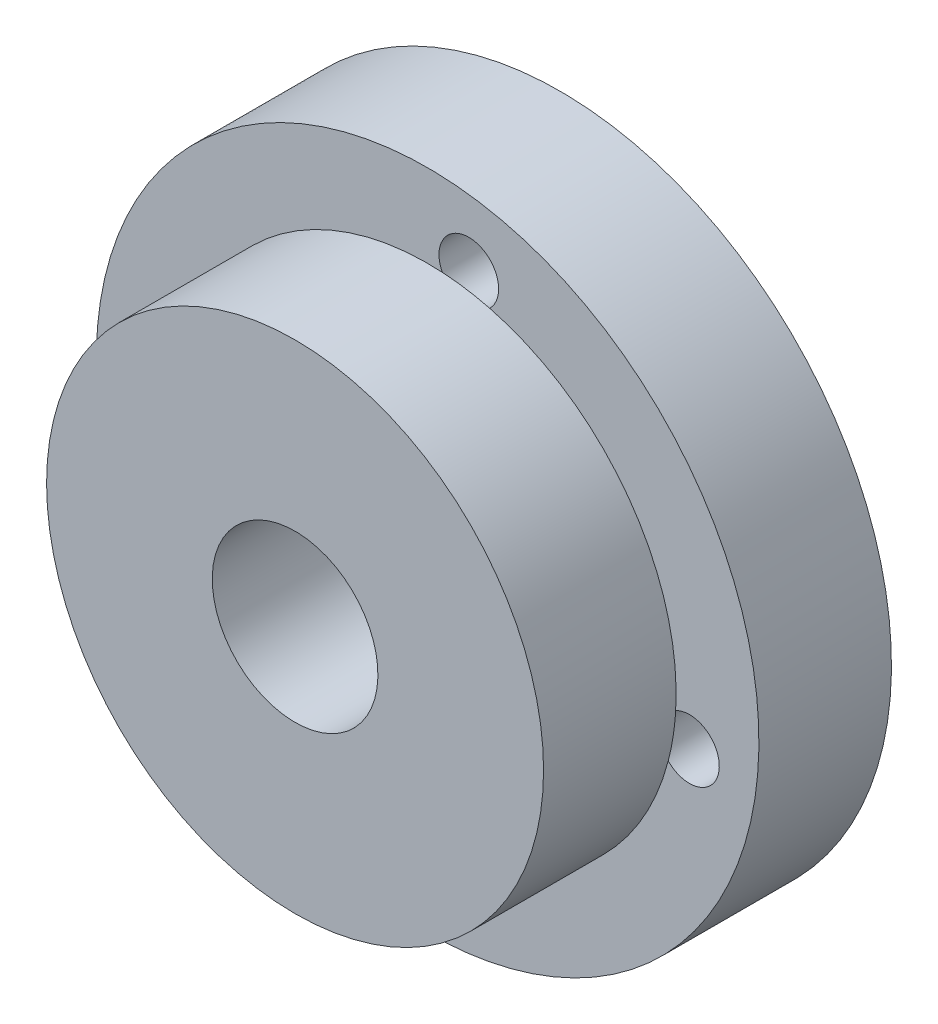
ISO-10303-21;
HEADER;
FILE_DESCRIPTION(('STEP AP214'),'2;1');
FILE_NAME('part.step','',(''),(''),'','','');
FILE_SCHEMA(('AUTOMOTIVE_DESIGN { 1 0 10303 214 1 1 1 1 }'));
ENDSEC;
DATA;
#1=APPLICATION_CONTEXT('core data for automotive mechanical design processes');
#2=APPLICATION_PROTOCOL_DEFINITION('international standard','automotive_design',2000,#1);
#3=PRODUCT_CONTEXT('',#1,'mechanical');
#4=PRODUCT('Part','Part','',(#3));
#5=PRODUCT_RELATED_PRODUCT_CATEGORY('part','',(#4));
#6=PRODUCT_DEFINITION_FORMATION('','',#4);
#7=PRODUCT_DEFINITION_CONTEXT('part definition',#1,'design');
#8=PRODUCT_DEFINITION('design','',#6,#7);
#9=PRODUCT_DEFINITION_SHAPE('','',#8);
#10=(LENGTH_UNIT() NAMED_UNIT(*) SI_UNIT(.MILLI.,.METRE.));
#11=(NAMED_UNIT(*) PLANE_ANGLE_UNIT() SI_UNIT($,.RADIAN.));
#12=(NAMED_UNIT(*) SI_UNIT($,.STERADIAN.) SOLID_ANGLE_UNIT());
#13=UNCERTAINTY_MEASURE_WITH_UNIT(LENGTH_MEASURE(1.E-05),#10,'distance_accuracy_value','');
#14=(GEOMETRIC_REPRESENTATION_CONTEXT(3) GLOBAL_UNCERTAINTY_ASSIGNED_CONTEXT((#13)) GLOBAL_UNIT_ASSIGNED_CONTEXT((#10,
#11,#12)) REPRESENTATION_CONTEXT('',''));
#15=CARTESIAN_POINT('',(0.,0.,0.));
#16=DIRECTION('',(0.,0.,1.));
#17=DIRECTION('',(1.,0.,0.));
#18=AXIS2_PLACEMENT_3D('',#15,#16,#17);
#19=CARTESIAN_POINT('',(172.540515397,-49.500004703,194.848278345));
#20=DIRECTION('',(0.,0.,1.));
#21=DIRECTION('',(1.,0.,0.));
#22=AXIS2_PLACEMENT_3D('',#19,#20,#21);
#23=PLANE('',#22);
#24=CARTESIAN_POINT('',(172.540515397,-49.500004703,194.848278345));
#25=DIRECTION('',(0.,0.,1.));
#26=DIRECTION('',(-0.987847219012841,0.15542802800202,0.));
#27=AXIS2_PLACEMENT_3D('',#24,#25,#26);
#28=CIRCLE('',#27,2.5);
#29=CARTESIAN_POINT('',(170.07089735,-49.111434632,194.848278345));
#30=VERTEX_POINT('',#29);
#31=CARTESIAN_POINT('',(175.010133445,-49.888574774,194.848278345));
#32=VERTEX_POINT('',#31);
#33=EDGE_CURVE('E207',#30,#32,#28,.T.);
#34=ORIENTED_EDGE('',*,*,#33,.T.);
#35=CARTESIAN_POINT('',(172.540515397,-49.500004703,194.848278345));
#36=DIRECTION('',(0.,0.,1.));
#37=DIRECTION('',(-0.987847219012841,0.15542802800202,0.));
#38=AXIS2_PLACEMENT_3D('',#35,#36,#37);
#39=CIRCLE('',#38,2.5);
#40=EDGE_CURVE('E165',#32,#30,#39,.T.);
#41=ORIENTED_EDGE('',*,*,#40,.T.);
#42=EDGE_LOOP('',(#34,#41));
#43=FACE_BOUND('',#42,.T.);
#44=CARTESIAN_POINT('',(180.443293149,-50.74342893,194.848278345));
#45=DIRECTION('',(0.,0.,1.));
#46=DIRECTION('',(0.987847219012841,-0.15542802800202,0.));
#47=AXIS2_PLACEMENT_3D('',#44,#45,#46);
#48=CIRCLE('',#47,0.9);
#49=CARTESIAN_POINT('',(181.332355646,-50.883314155,194.848278345));
#50=VERTEX_POINT('',#49);
#51=EDGE_CURVE('E258',#50,#50,#48,.T.);
#52=ORIENTED_EDGE('',*,*,#51,.T.);
#53=EDGE_LOOP('',(#52));
#54=FACE_BOUND('',#53,.T.);
#55=CARTESIAN_POINT('',(173.783939624,-41.597226951,194.848278345));
#56=DIRECTION('',(0.,0.,1.));
#57=DIRECTION('',(0.987847219012841,-0.15542802800202,0.));
#58=AXIS2_PLACEMENT_3D('',#55,#56,#57);
#59=CIRCLE('',#58,0.9);
#60=CARTESIAN_POINT('',(174.673002121,-41.737112177,194.848278345));
#61=VERTEX_POINT('',#60);
#62=CARTESIAN_POINT('',(173.923824849,-40.708164454,194.848278345));
#63=VERTEX_POINT('',#62);
#64=EDGE_CURVE('E225',#61,#63,#59,.T.);
#65=ORIENTED_EDGE('',*,*,#64,.T.);
#66=CARTESIAN_POINT('',(173.783939624,-41.597226951,194.848278345));
#67=DIRECTION('',(0.,0.,1.));
#68=DIRECTION('',(0.987847219012841,-0.15542802800202,0.));
#69=AXIS2_PLACEMENT_3D('',#66,#67,#68);
#70=CIRCLE('',#69,0.9);
#71=EDGE_CURVE('E229',#63,#61,#70,.T.);
#72=ORIENTED_EDGE('',*,*,#71,.T.);
#73=EDGE_LOOP('',(#65,#72));
#74=FACE_BOUND('',#73,.T.);
#75=CARTESIAN_POINT('',(164.637737646,-48.256580477,194.848278346));
#76=DIRECTION('',(0.,0.,1.));
#77=DIRECTION('',(0.987847219012841,-0.15542802800202,0.));
#78=AXIS2_PLACEMENT_3D('',#75,#76,#77);
#79=CIRCLE('',#78,0.9);
#80=CARTESIAN_POINT('',(165.526800143,-48.396465702,194.848278345));
#81=VERTEX_POINT('',#80);
#82=CARTESIAN_POINT('',(163.748675149,-48.116695251,194.848278346));
#83=VERTEX_POINT('',#82);
#84=EDGE_CURVE('E238',#81,#83,#79,.T.);
#85=ORIENTED_EDGE('',*,*,#84,.T.);
#86=CARTESIAN_POINT('',(164.637737646,-48.256580477,194.848278346));
#87=DIRECTION('',(0.,0.,1.));
#88=DIRECTION('',(0.987847219012841,-0.15542802800202,0.));
#89=AXIS2_PLACEMENT_3D('',#86,#87,#88);
#90=CIRCLE('',#89,0.9);
#91=EDGE_CURVE('E235',#83,#81,#90,.T.);
#92=ORIENTED_EDGE('',*,*,#91,.T.);
#93=EDGE_LOOP('',(#85,#92));
#94=FACE_BOUND('',#93,.T.);
#95=CARTESIAN_POINT('',(171.297091171,-57.402782455,194.848278345));
#96=DIRECTION('',(0.,0.,1.));
#97=DIRECTION('',(0.987847219012841,-0.15542802800202,0.));
#98=AXIS2_PLACEMENT_3D('',#95,#96,#97);
#99=CIRCLE('',#98,0.9);
#100=CARTESIAN_POINT('',(172.186153668,-57.54266768,194.848278345));
#101=VERTEX_POINT('',#100);
#102=CARTESIAN_POINT('',(171.157205945,-58.291844952,194.848278345));
#103=VERTEX_POINT('',#102);
#104=EDGE_CURVE('E19',#101,#103,#99,.T.);
#105=ORIENTED_EDGE('',*,*,#104,.T.);
#106=CARTESIAN_POINT('',(171.297091171,-57.402782455,194.848278345));
#107=DIRECTION('',(0.,0.,1.));
#108=DIRECTION('',(0.987847219012841,-0.15542802800202,0.));
#109=AXIS2_PLACEMENT_3D('',#106,#107,#108);
#110=CIRCLE('',#109,0.9);
#111=EDGE_CURVE('E272',#103,#101,#110,.T.);
#112=ORIENTED_EDGE('',*,*,#111,.T.);
#113=EDGE_LOOP('',(#105,#112));
#114=FACE_BOUND('',#113,.T.);
#115=CARTESIAN_POINT('',(172.540515397,-49.500004703,194.848278345));
#116=DIRECTION('',(0.,0.,-1.));
#117=DIRECTION('',(-0.987847219012841,0.15542802800202,0.));
#118=AXIS2_PLACEMENT_3D('',#115,#116,#117);
#119=CIRCLE('',#118,10.);
#120=CARTESIAN_POINT('',(162.662043208,-47.94572442,194.848278346));
#121=VERTEX_POINT('',#120);
#122=CARTESIAN_POINT('',(182.418987587,-51.054284986,194.848278345));
#123=VERTEX_POINT('',#122);
#124=EDGE_CURVE('E26',#121,#123,#119,.T.);
#125=ORIENTED_EDGE('',*,*,#124,.T.);
#126=CARTESIAN_POINT('',(172.540515397,-49.500004703,194.848278345));
#127=DIRECTION('',(0.,0.,-1.));
#128=DIRECTION('',(-0.987847219012841,0.15542802800202,0.));
#129=AXIS2_PLACEMENT_3D('',#126,#127,#128);
#130=CIRCLE('',#129,10.);
#131=EDGE_CURVE('E11',#123,#121,#130,.T.);
#132=ORIENTED_EDGE('',*,*,#131,.T.);
#133=EDGE_LOOP('',(#125,#132));
#134=FACE_BOUND('',#133,.T.);
#135=ADVANCED_FACE('F16',(#43,#54,#74,#94,#114,#134),#23,.F.);
#136=CARTESIAN_POINT('',(172.540515397,-49.500004703,194.848278345));
#137=DIRECTION('',(0.,0.,1.));
#138=DIRECTION('',(0.987847219012841,-0.15542802800202,0.));
#139=AXIS2_PLACEMENT_3D('',#136,#137,#138);
#140=CYLINDRICAL_SURFACE('',#139,10.);
#141=DIRECTION('',(0.,0.,-1.));
#142=VECTOR('',#141,1.);
#143=CARTESIAN_POINT('',(182.418987587,-51.054284986,198.848278345));
#144=LINE('',#143,#142);
#145=CARTESIAN_POINT('',(182.418987587,-51.054284986,198.848278345));
#146=VERTEX_POINT('',#145);
#147=EDGE_CURVE('E159',#146,#123,#144,.T.);
#148=ORIENTED_EDGE('',*,*,#147,.T.);
#149=ORIENTED_EDGE('',*,*,#124,.F.);
#150=ORIENTED_EDGE('',*,*,#131,.F.);
#151=ORIENTED_EDGE('',*,*,#147,.F.);
#152=CARTESIAN_POINT('',(172.540515397,-49.500004703,198.848278345));
#153=DIRECTION('',(0.,0.,1.));
#154=DIRECTION('',(-0.987847219012841,0.15542802800202,0.));
#155=AXIS2_PLACEMENT_3D('',#152,#153,#154);
#156=CIRCLE('',#155,10.);
#157=CARTESIAN_POINT('',(162.662043208,-47.94572442,198.848278346));
#158=VERTEX_POINT('',#157);
#159=EDGE_CURVE('E163',#158,#146,#156,.T.);
#160=ORIENTED_EDGE('',*,*,#159,.F.);
#161=CARTESIAN_POINT('',(172.540515397,-49.500004703,198.848278345));
#162=DIRECTION('',(0.,0.,1.));
#163=DIRECTION('',(-0.987847219012841,0.15542802800202,0.));
#164=AXIS2_PLACEMENT_3D('',#161,#162,#163);
#165=CIRCLE('',#164,10.);
#166=EDGE_CURVE('E167',#146,#158,#165,.T.);
#167=ORIENTED_EDGE('',*,*,#166,.F.);
#168=EDGE_LOOP('',(#148,#149,#150,#151,#160,#167));
#169=FACE_BOUND('',#168,.T.);
#170=ADVANCED_FACE('F161',(#169),#140,.T.);
#171=CARTESIAN_POINT('',(172.540515397,-49.500004703,194.848278345));
#172=DIRECTION('',(0.,0.,1.));
#173=DIRECTION('',(0.987847219012841,-0.15542802800202,0.));
#174=AXIS2_PLACEMENT_3D('',#171,#172,#173);
#175=CYLINDRICAL_SURFACE('',#174,2.5);
#176=DIRECTION('',(0.,0.,-1.));
#177=VECTOR('',#176,1.);
#178=CARTESIAN_POINT('',(175.010133445,-49.888574774,202.848278345));
#179=LINE('',#178,#177);
#180=CARTESIAN_POINT('',(175.010133445,-49.888574774,202.848278345));
#181=VERTEX_POINT('',#180);
#182=EDGE_CURVE('E211',#181,#32,#179,.T.);
#183=ORIENTED_EDGE('',*,*,#182,.F.);
#184=CARTESIAN_POINT('',(172.540515397,-49.500004703,202.848278345));
#185=DIRECTION('',(0.,0.,-1.));
#186=DIRECTION('',(-0.987847219012841,0.15542802800202,0.));
#187=AXIS2_PLACEMENT_3D('',#184,#185,#186);
#188=CIRCLE('',#187,2.5);
#189=CARTESIAN_POINT('',(170.07089735,-49.111434632,202.848278345));
#190=VERTEX_POINT('',#189);
#191=EDGE_CURVE('E180',#190,#181,#188,.T.);
#192=ORIENTED_EDGE('',*,*,#191,.F.);
#193=CARTESIAN_POINT('',(172.540515397,-49.500004703,202.848278345));
#194=DIRECTION('',(0.,0.,-1.));
#195=DIRECTION('',(-0.987847219012841,0.15542802800202,0.));
#196=AXIS2_PLACEMENT_3D('',#193,#194,#195);
#197=CIRCLE('',#196,2.5);
#198=EDGE_CURVE('E174',#181,#190,#197,.T.);
#199=ORIENTED_EDGE('',*,*,#198,.F.);
#200=ORIENTED_EDGE('',*,*,#182,.T.);
#201=ORIENTED_EDGE('',*,*,#33,.F.);
#202=ORIENTED_EDGE('',*,*,#40,.F.);
#203=EDGE_LOOP('',(#183,#192,#199,#200,#201,#202));
#204=FACE_BOUND('',#203,.T.);
#205=ADVANCED_FACE('F311',(#204),#175,.F.);
#206=CARTESIAN_POINT('',(180.443293149,-50.74342893,198.848278345));
#207=DIRECTION('',(0.,0.,-1.));
#208=DIRECTION('',(0.987847219012841,-0.15542802800202,0.));
#209=AXIS2_PLACEMENT_3D('',#206,#207,#208);
#210=CYLINDRICAL_SURFACE('',#209,0.9);
#211=DIRECTION('',(0.,0.,1.));
#212=VECTOR('',#211,1.);
#213=CARTESIAN_POINT('',(181.332355646,-50.883314155,194.848278345));
#214=LINE('',#213,#212);
#215=CARTESIAN_POINT('',(181.332355646,-50.883314155,198.848278345));
#216=VERTEX_POINT('',#215);
#217=EDGE_CURVE('E243',#50,#216,#214,.T.);
#218=ORIENTED_EDGE('',*,*,#217,.F.);
#219=ORIENTED_EDGE('',*,*,#51,.F.);
#220=ORIENTED_EDGE('',*,*,#217,.T.);
#221=CARTESIAN_POINT('',(180.443293149,-50.74342893,198.848278345));
#222=DIRECTION('',(0.,0.,-1.));
#223=DIRECTION('',(0.987847219012841,-0.15542802800202,0.));
#224=AXIS2_PLACEMENT_3D('',#221,#222,#223);
#225=CIRCLE('',#224,0.9);
#226=CARTESIAN_POINT('',(180.027281728,-49.945347168,198.848278345));
#227=VERTEX_POINT('',#226);
#228=EDGE_CURVE('E170',#227,#216,#225,.T.);
#229=ORIENTED_EDGE('',*,*,#228,.F.);
#230=CARTESIAN_POINT('',(180.443293149,-50.74342893,198.848278345));
#231=DIRECTION('',(0.,0.,-1.));
#232=DIRECTION('',(0.987847219012841,-0.15542802800202,0.));
#233=AXIS2_PLACEMENT_3D('',#230,#231,#232);
#234=CIRCLE('',#233,0.9);
#235=CARTESIAN_POINT('',(179.802308046,-51.3752027,198.848278345));
#236=VERTEX_POINT('',#235);
#237=EDGE_CURVE('E205',#236,#227,#234,.T.);
#238=ORIENTED_EDGE('',*,*,#237,.F.);
#239=CARTESIAN_POINT('',(180.443293149,-50.74342893,198.848278345));
#240=DIRECTION('',(0.,0.,-1.));
#241=DIRECTION('',(0.987847219012841,-0.15542802800202,0.));
#242=AXIS2_PLACEMENT_3D('',#239,#240,#241);
#243=CIRCLE('',#242,0.9);
#244=EDGE_CURVE('E189',#216,#236,#243,.T.);
#245=ORIENTED_EDGE('',*,*,#244,.F.);
#246=EDGE_LOOP('',(#218,#219,#220,#229,#238,#245));
#247=FACE_BOUND('',#246,.T.);
#248=ADVANCED_FACE('F337',(#247),#210,.F.);
#249=CARTESIAN_POINT('',(173.783939624,-41.597226951,198.848278345));
#250=DIRECTION('',(0.,0.,-1.));
#251=DIRECTION('',(0.15542802800202,0.987847219012841,0.));
#252=AXIS2_PLACEMENT_3D('',#249,#250,#251);
#253=CYLINDRICAL_SURFACE('',#252,0.9);
#254=DIRECTION('',(0.,0.,1.));
#255=VECTOR('',#254,1.);
#256=CARTESIAN_POINT('',(173.923824849,-40.708164454,194.848278345));
#257=LINE('',#256,#255);
#258=CARTESIAN_POINT('',(173.923824849,-40.708164454,198.848278345));
#259=VERTEX_POINT('',#258);
#260=EDGE_CURVE('E230',#63,#259,#257,.T.);
#261=ORIENTED_EDGE('',*,*,#260,.F.);
#262=ORIENTED_EDGE('',*,*,#64,.F.);
#263=ORIENTED_EDGE('',*,*,#71,.F.);
#264=ORIENTED_EDGE('',*,*,#260,.T.);
#265=CARTESIAN_POINT('',(173.783939624,-41.597226951,198.848278345));
#266=DIRECTION('',(0.,0.,-1.));
#267=DIRECTION('',(0.987847219012841,-0.15542802800202,0.));
#268=AXIS2_PLACEMENT_3D('',#265,#266,#267);
#269=CIRCLE('',#268,0.9);
#270=CARTESIAN_POINT('',(172.985857863,-42.013238372,198.848278345));
#271=VERTEX_POINT('',#270);
#272=EDGE_CURVE('E224',#271,#259,#269,.T.);
#273=ORIENTED_EDGE('',*,*,#272,.F.);
#274=CARTESIAN_POINT('',(173.783939624,-41.597226951,198.848278345));
#275=DIRECTION('',(0.,0.,-1.));
#276=DIRECTION('',(0.987847219012841,-0.15542802800202,0.));
#277=AXIS2_PLACEMENT_3D('',#274,#275,#276);
#278=CIRCLE('',#277,0.9);
#279=CARTESIAN_POINT('',(174.415713395,-42.238212055,198.848278345));
#280=VERTEX_POINT('',#279);
#281=EDGE_CURVE('E195',#280,#271,#278,.T.);
#282=ORIENTED_EDGE('',*,*,#281,.F.);
#283=CARTESIAN_POINT('',(173.783939624,-41.597226951,198.848278345));
#284=DIRECTION('',(0.,0.,-1.));
#285=DIRECTION('',(0.987847219012841,-0.15542802800202,0.));
#286=AXIS2_PLACEMENT_3D('',#283,#284,#285);
#287=CIRCLE('',#286,0.9);
#288=EDGE_CURVE('E219',#259,#280,#287,.T.);
#289=ORIENTED_EDGE('',*,*,#288,.F.);
#290=EDGE_LOOP('',(#261,#262,#263,#264,#273,#282,#289));
#291=FACE_BOUND('',#290,.T.);
#292=ADVANCED_FACE('F345',(#291),#253,.F.);
#293=CARTESIAN_POINT('',(164.637737646,-48.256580477,198.848278346));
#294=DIRECTION('',(0.,0.,-1.));
#295=DIRECTION('',(-0.987847219012841,0.15542802800202,0.));
#296=AXIS2_PLACEMENT_3D('',#293,#294,#295);
#297=CYLINDRICAL_SURFACE('',#296,0.9);
#298=DIRECTION('',(0.,0.,1.));
#299=VECTOR('',#298,1.);
#300=CARTESIAN_POINT('',(163.748675149,-48.116695251,194.848278346));
#301=LINE('',#300,#299);
#302=CARTESIAN_POINT('',(163.748675149,-48.116695251,198.848278346));
#303=VERTEX_POINT('',#302);
#304=EDGE_CURVE('E274',#83,#303,#301,.T.);
#305=ORIENTED_EDGE('',*,*,#304,.F.);
#306=ORIENTED_EDGE('',*,*,#84,.F.);
#307=ORIENTED_EDGE('',*,*,#91,.F.);
#308=ORIENTED_EDGE('',*,*,#304,.T.);
#309=CARTESIAN_POINT('',(164.637737646,-48.256580477,198.848278346));
#310=DIRECTION('',(0.,0.,-1.));
#311=DIRECTION('',(0.987847219012841,-0.15542802800202,0.));
#312=AXIS2_PLACEMENT_3D('',#309,#310,#311);
#313=CIRCLE('',#312,0.9);
#314=CARTESIAN_POINT('',(165.053749067,-49.054662238,198.848278346));
#315=VERTEX_POINT('',#314);
#316=EDGE_CURVE('E108',#315,#303,#313,.T.);
#317=ORIENTED_EDGE('',*,*,#316,.F.);
#318=CARTESIAN_POINT('',(164.637737646,-48.256580477,198.848278346));
#319=DIRECTION('',(0.,0.,-1.));
#320=DIRECTION('',(0.987847219012841,-0.15542802800202,0.));
#321=AXIS2_PLACEMENT_3D('',#318,#319,#320);
#322=CIRCLE('',#321,0.9);
#323=CARTESIAN_POINT('',(165.278722749,-47.624806706,198.848278346));
#324=VERTEX_POINT('',#323);
#325=EDGE_CURVE('E252',#324,#315,#322,.T.);
#326=ORIENTED_EDGE('',*,*,#325,.F.);
#327=CARTESIAN_POINT('',(164.637737646,-48.256580477,198.848278346));
#328=DIRECTION('',(0.,0.,-1.));
#329=DIRECTION('',(0.987847219012841,-0.15542802800202,0.));
#330=AXIS2_PLACEMENT_3D('',#327,#328,#329);
#331=CIRCLE('',#330,0.9);
#332=EDGE_CURVE('E97',#303,#324,#331,.T.);
#333=ORIENTED_EDGE('',*,*,#332,.F.);
#334=EDGE_LOOP('',(#305,#306,#307,#308,#317,#326,#333));
#335=FACE_BOUND('',#334,.T.);
#336=ADVANCED_FACE('F372',(#335),#297,.F.);
#337=CARTESIAN_POINT('',(171.297091171,-57.402782455,198.848278345));
#338=DIRECTION('',(0.,0.,-1.));
#339=DIRECTION('',(-0.15542802800202,-0.987847219012841,0.));
#340=AXIS2_PLACEMENT_3D('',#337,#338,#339);
#341=CYLINDRICAL_SURFACE('',#340,0.9);
#342=DIRECTION('',(0.,0.,1.));
#343=VECTOR('',#342,1.);
#344=CARTESIAN_POINT('',(171.157205945,-58.291844952,194.848278345));
#345=LINE('',#344,#343);
#346=CARTESIAN_POINT('',(171.157205945,-58.291844952,198.848278345));
#347=VERTEX_POINT('',#346);
#348=EDGE_CURVE('E223',#103,#347,#345,.T.);
#349=ORIENTED_EDGE('',*,*,#348,.F.);
#350=ORIENTED_EDGE('',*,*,#104,.F.);
#351=ORIENTED_EDGE('',*,*,#111,.F.);
#352=ORIENTED_EDGE('',*,*,#348,.T.);
#353=CARTESIAN_POINT('',(171.297091171,-57.402782455,198.848278345));
#354=DIRECTION('',(0.,0.,-1.));
#355=DIRECTION('',(0.987847219012841,-0.15542802800202,0.));
#356=AXIS2_PLACEMENT_3D('',#353,#354,#355);
#357=CIRCLE('',#356,0.9);
#358=CARTESIAN_POINT('',(172.095172932,-56.986771034,198.848278345));
#359=VERTEX_POINT('',#358);
#360=EDGE_CURVE('E185',#359,#347,#357,.T.);
#361=ORIENTED_EDGE('',*,*,#360,.F.);
#362=CARTESIAN_POINT('',(171.297091171,-57.402782455,198.848278345));
#363=DIRECTION('',(0.,0.,-1.));
#364=DIRECTION('',(0.987847219012841,-0.15542802800202,0.));
#365=AXIS2_PLACEMENT_3D('',#362,#363,#364);
#366=CIRCLE('',#365,0.9);
#367=CARTESIAN_POINT('',(170.6653174,-56.761797352,198.848278345));
#368=VERTEX_POINT('',#367);
#369=EDGE_CURVE('E206',#368,#359,#366,.T.);
#370=ORIENTED_EDGE('',*,*,#369,.F.);
#371=CARTESIAN_POINT('',(171.297091171,-57.402782455,198.848278345));
#372=DIRECTION('',(0.,0.,-1.));
#373=DIRECTION('',(0.987847219012841,-0.15542802800202,0.));
#374=AXIS2_PLACEMENT_3D('',#371,#372,#373);
#375=CIRCLE('',#374,0.9);
#376=EDGE_CURVE('E188',#347,#368,#375,.T.);
#377=ORIENTED_EDGE('',*,*,#376,.F.);
#378=EDGE_LOOP('',(#349,#350,#351,#352,#361,#370,#377));
#379=FACE_BOUND('',#378,.T.);
#380=ADVANCED_FACE('F365',(#379),#341,.F.);
#381=CARTESIAN_POINT('',(172.540515397,-49.500004703,198.848278345));
#382=DIRECTION('',(0.,0.,1.));
#383=DIRECTION('',(1.,0.,0.));
#384=AXIS2_PLACEMENT_3D('',#381,#382,#383);
#385=PLANE('',#384);
#386=CARTESIAN_POINT('',(172.540515397,-49.500004703,198.848278345));
#387=DIRECTION('',(0.,0.,-1.));
#388=DIRECTION('',(-0.987847219012841,0.15542802800202,0.));
#389=AXIS2_PLACEMENT_3D('',#386,#387,#388);
#390=CIRCLE('',#389,7.5);
#391=EDGE_CURVE('E214',#280,#227,#390,.T.);
#392=ORIENTED_EDGE('',*,*,#391,.T.);
#393=ORIENTED_EDGE('',*,*,#228,.T.);
#394=ORIENTED_EDGE('',*,*,#244,.T.);
#395=CARTESIAN_POINT('',(172.540515397,-49.500004703,198.848278345));
#396=DIRECTION('',(0.,0.,-1.));
#397=DIRECTION('',(-0.987847219012841,0.15542802800202,0.));
#398=AXIS2_PLACEMENT_3D('',#395,#396,#397);
#399=CIRCLE('',#398,7.5);
#400=EDGE_CURVE('E199',#236,#359,#399,.T.);
#401=ORIENTED_EDGE('',*,*,#400,.T.);
#402=ORIENTED_EDGE('',*,*,#360,.T.);
#403=ORIENTED_EDGE('',*,*,#376,.T.);
#404=CARTESIAN_POINT('',(172.540515397,-49.500004703,198.848278345));
#405=DIRECTION('',(0.,0.,-1.));
#406=DIRECTION('',(-0.987847219012841,0.15542802800202,0.));
#407=AXIS2_PLACEMENT_3D('',#404,#405,#406);
#408=CIRCLE('',#407,7.5);
#409=EDGE_CURVE('E196',#368,#315,#408,.T.);
#410=ORIENTED_EDGE('',*,*,#409,.T.);
#411=ORIENTED_EDGE('',*,*,#316,.T.);
#412=ORIENTED_EDGE('',*,*,#332,.T.);
#413=CARTESIAN_POINT('',(172.540515397,-49.500004703,198.848278345));
#414=DIRECTION('',(0.,0.,-1.));
#415=DIRECTION('',(-0.987847219012841,0.15542802800202,0.));
#416=AXIS2_PLACEMENT_3D('',#413,#414,#415);
#417=CIRCLE('',#416,7.5);
#418=EDGE_CURVE('E200',#324,#271,#417,.T.);
#419=ORIENTED_EDGE('',*,*,#418,.T.);
#420=ORIENTED_EDGE('',*,*,#272,.T.);
#421=ORIENTED_EDGE('',*,*,#288,.T.);
#422=EDGE_LOOP('',(#392,#393,#394,#401,#402,#403,#410,#411,#412,#419,#420,#421));
#423=FACE_BOUND('',#422,.T.);
#424=ORIENTED_EDGE('',*,*,#159,.T.);
#425=ORIENTED_EDGE('',*,*,#166,.T.);
#426=EDGE_LOOP('',(#424,#425));
#427=FACE_BOUND('',#426,.T.);
#428=ADVANCED_FACE('F172',(#423,#427),#385,.T.);
#429=CARTESIAN_POINT('',(172.540515397,-49.500004703,202.848278345));
#430=DIRECTION('',(0.,0.,1.));
#431=DIRECTION('',(1.,0.,0.));
#432=AXIS2_PLACEMENT_3D('',#429,#430,#431);
#433=PLANE('',#432);
#434=ORIENTED_EDGE('',*,*,#191,.T.);
#435=ORIENTED_EDGE('',*,*,#198,.T.);
#436=EDGE_LOOP('',(#434,#435));
#437=FACE_BOUND('',#436,.T.);
#438=CARTESIAN_POINT('',(172.540515397,-49.500004703,202.848278345));
#439=DIRECTION('',(0.,0.,1.));
#440=DIRECTION('',(-0.987847219012841,0.15542802800202,0.));
#441=AXIS2_PLACEMENT_3D('',#438,#439,#440);
#442=CIRCLE('',#441,7.5);
#443=CARTESIAN_POINT('',(165.131661255,-48.334294491,202.848278346));
#444=VERTEX_POINT('',#443);
#445=CARTESIAN_POINT('',(179.94936954,-50.665714915,202.848278345));
#446=VERTEX_POINT('',#445);
#447=EDGE_CURVE('E218',#444,#446,#442,.T.);
#448=ORIENTED_EDGE('',*,*,#447,.T.);
#449=CARTESIAN_POINT('',(172.540515397,-49.500004703,202.848278345));
#450=DIRECTION('',(0.,0.,1.));
#451=DIRECTION('',(-0.987847219012841,0.15542802800202,0.));
#452=AXIS2_PLACEMENT_3D('',#449,#450,#451);
#453=CIRCLE('',#452,7.5);
#454=EDGE_CURVE('E215',#446,#444,#453,.T.);
#455=ORIENTED_EDGE('',*,*,#454,.T.);
#456=EDGE_LOOP('',(#448,#455));
#457=FACE_BOUND('',#456,.T.);
#458=ADVANCED_FACE('F315',(#437,#457),#433,.T.);
#459=CARTESIAN_POINT('',(172.540515397,-49.500004703,198.848278345));
#460=DIRECTION('',(0.,0.,1.));
#461=DIRECTION('',(0.987847219012841,-0.15542802800202,0.));
#462=AXIS2_PLACEMENT_3D('',#459,#460,#461);
#463=CYLINDRICAL_SURFACE('',#462,7.5);
#464=DIRECTION('',(0.,0.,-1.));
#465=VECTOR('',#464,1.);
#466=CARTESIAN_POINT('',(179.94936954,-50.665714915,202.848278345));
#467=LINE('',#466,#465);
#468=CARTESIAN_POINT('',(179.94936954,-50.665714915,198.848278345));
#469=VERTEX_POINT('',#468);
#470=EDGE_CURVE('E194',#446,#469,#467,.T.);
#471=ORIENTED_EDGE('',*,*,#470,.T.);
#472=CARTESIAN_POINT('',(172.540515397,-49.500004703,198.848278345));
#473=DIRECTION('',(0.,0.,-1.));
#474=DIRECTION('',(-0.987847219012841,0.15542802800202,0.));
#475=AXIS2_PLACEMENT_3D('',#472,#473,#474);
#476=CIRCLE('',#475,7.5);
#477=EDGE_CURVE('E247',#227,#469,#476,.T.);
#478=ORIENTED_EDGE('',*,*,#477,.F.);
#479=ORIENTED_EDGE('',*,*,#391,.F.);
#480=CARTESIAN_POINT('',(172.540515397,-49.500004703,198.848278345));
#481=DIRECTION('',(0.,0.,-1.));
#482=DIRECTION('',(-0.987847219012841,0.15542802800202,0.));
#483=AXIS2_PLACEMENT_3D('',#480,#481,#482);
#484=CIRCLE('',#483,7.5);
#485=EDGE_CURVE('E190',#271,#280,#484,.T.);
#486=ORIENTED_EDGE('',*,*,#485,.F.);
#487=ORIENTED_EDGE('',*,*,#418,.F.);
#488=CARTESIAN_POINT('',(172.540515397,-49.500004703,198.848278345));
#489=DIRECTION('',(0.,0.,-1.));
#490=DIRECTION('',(-0.987847219012841,0.15542802800202,0.));
#491=AXIS2_PLACEMENT_3D('',#488,#489,#490);
#492=CIRCLE('',#491,7.5);
#493=EDGE_CURVE('E248',#315,#324,#492,.T.);
#494=ORIENTED_EDGE('',*,*,#493,.F.);
#495=ORIENTED_EDGE('',*,*,#409,.F.);
#496=CARTESIAN_POINT('',(172.540515397,-49.500004703,198.848278345));
#497=DIRECTION('',(0.,0.,-1.));
#498=DIRECTION('',(-0.987847219012841,0.15542802800202,0.));
#499=AXIS2_PLACEMENT_3D('',#496,#497,#498);
#500=CIRCLE('',#499,7.5);
#501=EDGE_CURVE('E201',#359,#368,#500,.T.);
#502=ORIENTED_EDGE('',*,*,#501,.F.);
#503=ORIENTED_EDGE('',*,*,#400,.F.);
#504=CARTESIAN_POINT('',(172.540515397,-49.500004703,198.848278345));
#505=DIRECTION('',(0.,0.,-1.));
#506=DIRECTION('',(-0.987847219012841,0.15542802800202,0.));
#507=AXIS2_PLACEMENT_3D('',#504,#505,#506);
#508=CIRCLE('',#507,7.5);
#509=EDGE_CURVE('E268',#469,#236,#508,.T.);
#510=ORIENTED_EDGE('',*,*,#509,.F.);
#511=ORIENTED_EDGE('',*,*,#470,.F.);
#512=ORIENTED_EDGE('',*,*,#447,.F.);
#513=ORIENTED_EDGE('',*,*,#454,.F.);
#514=EDGE_LOOP('',(#471,#478,#479,#486,#487,#494,#495,#502,#503,#510,#511,#512,#513));
#515=FACE_BOUND('',#514,.T.);
#516=ADVANCED_FACE('F318',(#515),#463,.T.);
#517=CARTESIAN_POINT('',(172.540515397,-49.500004703,198.848278345));
#518=DIRECTION('',(0.,0.,1.));
#519=DIRECTION('',(1.,0.,0.));
#520=AXIS2_PLACEMENT_3D('',#517,#518,#519);
#521=PLANE('',#520);
#522=ORIENTED_EDGE('',*,*,#281,.T.);
#523=ORIENTED_EDGE('',*,*,#485,.T.);
#524=EDGE_LOOP('',(#522,#523));
#525=FACE_BOUND('',#524,.T.);
#526=ADVANCED_FACE('F396',(#525),#521,.F.);
#527=CARTESIAN_POINT('',(172.540515397,-49.500004703,198.848278345));
#528=DIRECTION('',(0.,0.,1.));
#529=DIRECTION('',(1.,0.,0.));
#530=AXIS2_PLACEMENT_3D('',#527,#528,#529);
#531=PLANE('',#530);
#532=ORIENTED_EDGE('',*,*,#237,.T.);
#533=ORIENTED_EDGE('',*,*,#477,.T.);
#534=ORIENTED_EDGE('',*,*,#509,.T.);
#535=EDGE_LOOP('',(#532,#533,#534));
#536=FACE_BOUND('',#535,.T.);
#537=ADVANCED_FACE('F333',(#536),#531,.F.);
#538=CARTESIAN_POINT('',(172.540515397,-49.500004703,198.848278345));
#539=DIRECTION('',(0.,0.,1.));
#540=DIRECTION('',(1.,0.,0.));
#541=AXIS2_PLACEMENT_3D('',#538,#539,#540);
#542=PLANE('',#541);
#543=ORIENTED_EDGE('',*,*,#369,.T.);
#544=ORIENTED_EDGE('',*,*,#501,.T.);
#545=EDGE_LOOP('',(#543,#544));
#546=FACE_BOUND('',#545,.T.);
#547=ADVANCED_FACE('F363',(#546),#542,.F.);
#548=CARTESIAN_POINT('',(172.540515397,-49.500004703,198.848278345));
#549=DIRECTION('',(0.,0.,1.));
#550=DIRECTION('',(1.,0.,0.));
#551=AXIS2_PLACEMENT_3D('',#548,#549,#550);
#552=PLANE('',#551);
#553=ORIENTED_EDGE('',*,*,#325,.T.);
#554=ORIENTED_EDGE('',*,*,#493,.T.);
#555=EDGE_LOOP('',(#553,#554));
#556=FACE_BOUND('',#555,.T.);
#557=ADVANCED_FACE('F370',(#556),#552,.F.);
#558=CLOSED_SHELL('',(#135,#170,#205,#248,#292,#336,#380,#428,#458,#516,#526,#537,#547,#557));
#559=MANIFOLD_SOLID_BREP('B1',#558);
#560=ADVANCED_BREP_SHAPE_REPRESENTATION('',(#18,#559),#14);
#561=SHAPE_DEFINITION_REPRESENTATION(#9,#560);
ENDSEC;
END-ISO-10303-21;
